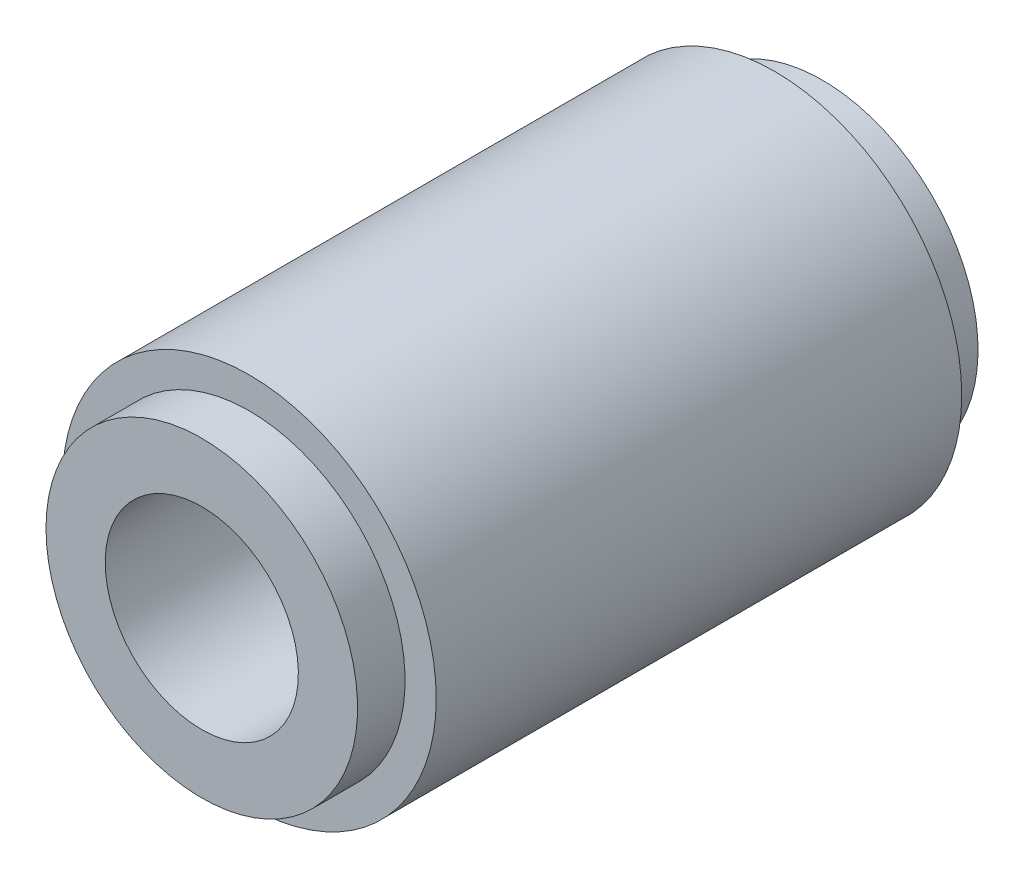
ISO-10303-21;
HEADER;
FILE_DESCRIPTION(('STEP AP214'),'2;1');
FILE_NAME('part.step','',(''),(''),'','','');
FILE_SCHEMA(('AUTOMOTIVE_DESIGN { 1 0 10303 214 1 1 1 1 }'));
ENDSEC;
DATA;
#1=APPLICATION_CONTEXT('core data for automotive mechanical design processes');
#2=APPLICATION_PROTOCOL_DEFINITION('international standard','automotive_design',2000,#1);
#3=PRODUCT_CONTEXT('',#1,'mechanical');
#4=PRODUCT('Part','Part','',(#3));
#5=PRODUCT_RELATED_PRODUCT_CATEGORY('part','',(#4));
#6=PRODUCT_DEFINITION_FORMATION('','',#4);
#7=PRODUCT_DEFINITION_CONTEXT('part definition',#1,'design');
#8=PRODUCT_DEFINITION('design','',#6,#7);
#9=PRODUCT_DEFINITION_SHAPE('','',#8);
#10=(LENGTH_UNIT() NAMED_UNIT(*) SI_UNIT(.MILLI.,.METRE.));
#11=(NAMED_UNIT(*) PLANE_ANGLE_UNIT() SI_UNIT($,.RADIAN.));
#12=(NAMED_UNIT(*) SI_UNIT($,.STERADIAN.) SOLID_ANGLE_UNIT());
#13=UNCERTAINTY_MEASURE_WITH_UNIT(LENGTH_MEASURE(1.E-05),#10,'distance_accuracy_value','');
#14=(GEOMETRIC_REPRESENTATION_CONTEXT(3) GLOBAL_UNCERTAINTY_ASSIGNED_CONTEXT((#13)) GLOBAL_UNIT_ASSIGNED_CONTEXT((#10,
#11,#12)) REPRESENTATION_CONTEXT('',''));
#15=CARTESIAN_POINT('',(0.,0.,0.));
#16=DIRECTION('',(0.,0.,1.));
#17=DIRECTION('',(1.,0.,0.));
#18=AXIS2_PLACEMENT_3D('',#15,#16,#17);
#19=CARTESIAN_POINT('',(0.,0.,4.2164));
#20=DIRECTION('',(0.,0.,-1.));
#21=DIRECTION('',(-1.,0.,0.));
#22=AXIS2_PLACEMENT_3D('',#19,#20,#21);
#23=CYLINDRICAL_SURFACE('',#22,1.5);
#24=CARTESIAN_POINT('',(0.,0.,0.));
#25=DIRECTION('',(0.,0.,-1.));
#26=DIRECTION('',(-1.,0.,0.));
#27=AXIS2_PLACEMENT_3D('',#24,#25,#26);
#28=CIRCLE('',#27,1.5);
#29=CARTESIAN_POINT('',(-1.5,0.,0.));
#30=VERTEX_POINT('',#29);
#31=EDGE_CURVE('E19',#30,#30,#28,.F.);
#32=ORIENTED_EDGE('',*,*,#31,.T.);
#33=EDGE_LOOP('',(#32));
#34=FACE_BOUND('',#33,.T.);
#35=CARTESIAN_POINT('',(0.,0.,4.2164));
#36=DIRECTION('',(0.,0.,-1.));
#37=DIRECTION('',(-1.,0.,0.));
#38=AXIS2_PLACEMENT_3D('',#35,#36,#37);
#39=CIRCLE('',#38,1.5);
#40=CARTESIAN_POINT('',(-1.5,0.,4.2164));
#41=VERTEX_POINT('',#40);
#42=EDGE_CURVE('E41',#41,#41,#39,.F.);
#43=ORIENTED_EDGE('',*,*,#42,.F.);
#44=EDGE_LOOP('',(#43));
#45=FACE_BOUND('',#44,.T.);
#46=ADVANCED_FACE('F15',(#34,#45),#23,.T.);
#47=CARTESIAN_POINT('',(-1.518,-1.518,0.));
#48=DIRECTION('',(0.,0.,1.));
#49=DIRECTION('',(1.,0.,0.));
#50=AXIS2_PLACEMENT_3D('',#47,#48,#49);
#51=PLANE('',#50);
#52=CARTESIAN_POINT('',(0.,0.,0.));
#53=DIRECTION('',(0.,0.,1.));
#54=DIRECTION('',(0.,-1.,0.));
#55=AXIS2_PLACEMENT_3D('',#52,#53,#54);
#56=CIRCLE('',#55,1.25);
#57=CARTESIAN_POINT('',(0.,-1.25,0.));
#58=VERTEX_POINT('',#57);
#59=EDGE_CURVE('E39',#58,#58,#56,.T.);
#60=ORIENTED_EDGE('',*,*,#59,.T.);
#61=EDGE_LOOP('',(#60));
#62=FACE_BOUND('',#61,.T.);
#63=ORIENTED_EDGE('',*,*,#31,.F.);
#64=EDGE_LOOP('',(#63));
#65=FACE_BOUND('',#64,.T.);
#66=ADVANCED_FACE('F50',(#62,#65),#51,.F.);
#67=CARTESIAN_POINT('',(-1.518,-1.518,4.2164));
#68=DIRECTION('',(0.,0.,1.));
#69=DIRECTION('',(1.,0.,0.));
#70=AXIS2_PLACEMENT_3D('',#67,#68,#69);
#71=PLANE('',#70);
#72=CARTESIAN_POINT('',(0.,0.,4.2164));
#73=DIRECTION('',(0.,0.,-1.));
#74=DIRECTION('',(-1.,0.,0.));
#75=AXIS2_PLACEMENT_3D('',#72,#73,#74);
#76=CIRCLE('',#75,1.25);
#77=CARTESIAN_POINT('',(-1.25,0.,4.2164));
#78=VERTEX_POINT('',#77);
#79=EDGE_CURVE('E36',#78,#78,#76,.T.);
#80=ORIENTED_EDGE('',*,*,#79,.T.);
#81=EDGE_LOOP('',(#80));
#82=FACE_BOUND('',#81,.T.);
#83=ORIENTED_EDGE('',*,*,#42,.T.);
#84=EDGE_LOOP('',(#83));
#85=FACE_BOUND('',#84,.T.);
#86=ADVANCED_FACE('F52',(#82,#85),#71,.T.);
#87=CARTESIAN_POINT('',(0.,0.,-0.381));
#88=DIRECTION('',(0.,0.,1.));
#89=DIRECTION('',(0.,-1.,0.));
#90=AXIS2_PLACEMENT_3D('',#87,#88,#89);
#91=CYLINDRICAL_SURFACE('',#90,1.25);
#92=ORIENTED_EDGE('',*,*,#59,.F.);
#93=EDGE_LOOP('',(#92));
#94=FACE_BOUND('',#93,.T.);
#95=CARTESIAN_POINT('',(0.,0.,-0.381));
#96=DIRECTION('',(0.,0.,1.));
#97=DIRECTION('',(0.,-1.,0.));
#98=AXIS2_PLACEMENT_3D('',#95,#96,#97);
#99=CIRCLE('',#98,1.25);
#100=CARTESIAN_POINT('',(0.,-1.25,-0.381));
#101=VERTEX_POINT('',#100);
#102=EDGE_CURVE('E33',#101,#101,#99,.F.);
#103=ORIENTED_EDGE('',*,*,#102,.F.);
#104=EDGE_LOOP('',(#103));
#105=FACE_BOUND('',#104,.T.);
#106=ADVANCED_FACE('F60',(#94,#105),#91,.T.);
#107=CARTESIAN_POINT('',(0.,0.,4.5974));
#108=DIRECTION('',(0.,0.,-1.));
#109=DIRECTION('',(-1.,0.,0.));
#110=AXIS2_PLACEMENT_3D('',#107,#108,#109);
#111=CYLINDRICAL_SURFACE('',#110,1.25);
#112=ORIENTED_EDGE('',*,*,#79,.F.);
#113=EDGE_LOOP('',(#112));
#114=FACE_BOUND('',#113,.T.);
#115=CARTESIAN_POINT('',(0.,0.,4.5974));
#116=DIRECTION('',(0.,0.,-1.));
#117=DIRECTION('',(-1.,0.,0.));
#118=AXIS2_PLACEMENT_3D('',#115,#116,#117);
#119=CIRCLE('',#118,1.25);
#120=CARTESIAN_POINT('',(-1.25,0.,4.5974));
#121=VERTEX_POINT('',#120);
#122=EDGE_CURVE('E28',#121,#121,#119,.F.);
#123=ORIENTED_EDGE('',*,*,#122,.F.);
#124=EDGE_LOOP('',(#123));
#125=FACE_BOUND('',#124,.T.);
#126=ADVANCED_FACE('F74',(#114,#125),#111,.T.);
#127=CARTESIAN_POINT('',(1.265,-1.265,-0.381));
#128=DIRECTION('',(0.,0.,-1.));
#129=DIRECTION('',(-1.,0.,0.));
#130=AXIS2_PLACEMENT_3D('',#127,#128,#129);
#131=PLANE('',#130);
#132=CARTESIAN_POINT('',(0.,0.,-0.381));
#133=DIRECTION('',(0.,0.,1.));
#134=DIRECTION('',(0.,-1.,0.));
#135=AXIS2_PLACEMENT_3D('',#132,#133,#134);
#136=CIRCLE('',#135,0.775);
#137=CARTESIAN_POINT('',(0.,-0.775,-0.381));
#138=VERTEX_POINT('',#137);
#139=EDGE_CURVE('E23',#138,#138,#136,.F.);
#140=ORIENTED_EDGE('',*,*,#139,.F.);
#141=EDGE_LOOP('',(#140));
#142=FACE_BOUND('',#141,.T.);
#143=ORIENTED_EDGE('',*,*,#102,.T.);
#144=EDGE_LOOP('',(#143));
#145=FACE_BOUND('',#144,.T.);
#146=ADVANCED_FACE('F70',(#142,#145),#131,.T.);
#147=CARTESIAN_POINT('',(-1.265,-1.265,4.5974));
#148=DIRECTION('',(0.,0.,1.));
#149=DIRECTION('',(1.,0.,0.));
#150=AXIS2_PLACEMENT_3D('',#147,#148,#149);
#151=PLANE('',#150);
#152=CARTESIAN_POINT('',(0.,0.,4.5974));
#153=DIRECTION('',(0.,0.,1.));
#154=DIRECTION('',(0.,-1.,0.));
#155=AXIS2_PLACEMENT_3D('',#152,#153,#154);
#156=CIRCLE('',#155,0.775);
#157=CARTESIAN_POINT('',(0.,-0.775,4.5974));
#158=VERTEX_POINT('',#157);
#159=EDGE_CURVE('E10',#158,#158,#156,.T.);
#160=ORIENTED_EDGE('',*,*,#159,.F.);
#161=EDGE_LOOP('',(#160));
#162=FACE_BOUND('',#161,.T.);
#163=ORIENTED_EDGE('',*,*,#122,.T.);
#164=EDGE_LOOP('',(#163));
#165=FACE_BOUND('',#164,.T.);
#166=ADVANCED_FACE('F17',(#162,#165),#151,.T.);
#167=CARTESIAN_POINT('',(0.,0.,-0.381));
#168=DIRECTION('',(0.,0.,1.));
#169=DIRECTION('',(0.,-1.,0.));
#170=AXIS2_PLACEMENT_3D('',#167,#168,#169);
#171=CYLINDRICAL_SURFACE('',#170,0.775);
#172=ORIENTED_EDGE('',*,*,#159,.T.);
#173=EDGE_LOOP('',(#172));
#174=FACE_BOUND('',#173,.T.);
#175=ORIENTED_EDGE('',*,*,#139,.T.);
#176=EDGE_LOOP('',(#175));
#177=FACE_BOUND('',#176,.T.);
#178=ADVANCED_FACE('F64',(#174,#177),#171,.F.);
#179=CLOSED_SHELL('',(#46,#66,#86,#106,#126,#146,#166,#178));
#180=MANIFOLD_SOLID_BREP('B1',#179);
#181=ADVANCED_BREP_SHAPE_REPRESENTATION('',(#18,#180),#14);
#182=SHAPE_DEFINITION_REPRESENTATION(#9,#181);
ENDSEC;
END-ISO-10303-21;
